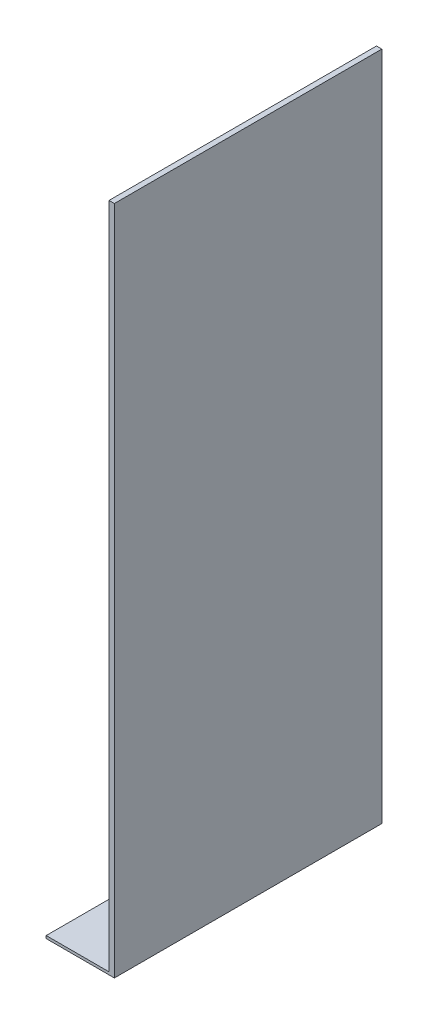
ISO-10303-21;
HEADER;
FILE_DESCRIPTION(('STEP AP214'),'2;1');
FILE_NAME('part.step','',(''),(''),'','','');
FILE_SCHEMA(('AUTOMOTIVE_DESIGN { 1 0 10303 214 1 1 1 1 }'));
ENDSEC;
DATA;
#1=APPLICATION_CONTEXT('core data for automotive mechanical design processes');
#2=APPLICATION_PROTOCOL_DEFINITION('international standard','automotive_design',2000,#1);
#3=PRODUCT_CONTEXT('',#1,'mechanical');
#4=PRODUCT('Part','Part','',(#3));
#5=PRODUCT_RELATED_PRODUCT_CATEGORY('part','',(#4));
#6=PRODUCT_DEFINITION_FORMATION('','',#4);
#7=PRODUCT_DEFINITION_CONTEXT('part definition',#1,'design');
#8=PRODUCT_DEFINITION('design','',#6,#7);
#9=PRODUCT_DEFINITION_SHAPE('','',#8);
#10=(LENGTH_UNIT() NAMED_UNIT(*) SI_UNIT(.MILLI.,.METRE.));
#11=(NAMED_UNIT(*) PLANE_ANGLE_UNIT() SI_UNIT($,.RADIAN.));
#12=(NAMED_UNIT(*) SI_UNIT($,.STERADIAN.) SOLID_ANGLE_UNIT());
#13=UNCERTAINTY_MEASURE_WITH_UNIT(LENGTH_MEASURE(1.E-05),#10,'distance_accuracy_value','');
#14=(GEOMETRIC_REPRESENTATION_CONTEXT(3) GLOBAL_UNCERTAINTY_ASSIGNED_CONTEXT((#13)) GLOBAL_UNIT_ASSIGNED_CONTEXT((#10,
#11,#12)) REPRESENTATION_CONTEXT('',''));
#15=CARTESIAN_POINT('',(0.,0.,0.));
#16=DIRECTION('',(0.,0.,1.));
#17=DIRECTION('',(1.,0.,0.));
#18=AXIS2_PLACEMENT_3D('',#15,#16,#17);
#19=CARTESIAN_POINT('',(0.,0.,0.));
#20=DIRECTION('',(1.,0.,0.));
#21=DIRECTION('',(0.,0.,-1.));
#22=AXIS2_PLACEMENT_3D('',#19,#20,#21);
#23=PLANE('',#22);
#24=DIRECTION('',(0.,0.,-1.));
#25=VECTOR('',#24,1.);
#26=CARTESIAN_POINT('',(0.,-395.820930232558,-61.2790697674419));
#27=LINE('',#26,#25);
#28=CARTESIAN_POINT('',(0.,-395.820930232558,138.720930232558));
#29=VERTEX_POINT('',#28);
#30=CARTESIAN_POINT('',(0.,-395.820930232558,-61.2790697674419));
#31=VERTEX_POINT('',#30);
#32=EDGE_CURVE('E57',#29,#31,#27,.T.);
#33=ORIENTED_EDGE('',*,*,#32,.F.);
#34=DIRECTION('',(0.,-1.,0.));
#35=VECTOR('',#34,1.);
#36=CARTESIAN_POINT('',(0.,103.779069767442,138.720930232558));
#37=LINE('',#36,#35);
#38=CARTESIAN_POINT('',(0.,103.779069767442,138.720930232558));
#39=VERTEX_POINT('',#38);
#40=EDGE_CURVE('E142',#39,#29,#37,.T.);
#41=ORIENTED_EDGE('',*,*,#40,.F.);
#42=DIRECTION('',(0.,0.,1.));
#43=VECTOR('',#42,1.);
#44=CARTESIAN_POINT('',(0.,103.779069767442,138.720930232558));
#45=LINE('',#44,#43);
#46=CARTESIAN_POINT('',(0.,103.779069767442,-61.2790697674419));
#47=VERTEX_POINT('',#46);
#48=EDGE_CURVE('E81',#47,#39,#45,.T.);
#49=ORIENTED_EDGE('',*,*,#48,.F.);
#50=DIRECTION('',(0.,1.,0.));
#51=VECTOR('',#50,1.);
#52=CARTESIAN_POINT('',(0.,103.779069767442,-61.2790697674419));
#53=LINE('',#52,#51);
#54=EDGE_CURVE('E155',#31,#47,#53,.T.);
#55=ORIENTED_EDGE('',*,*,#54,.F.);
#56=EDGE_LOOP('',(#33,#41,#49,#55));
#57=FACE_BOUND('',#56,.T.);
#58=ADVANCED_FACE('F41',(#57),#23,.F.);
#59=CARTESIAN_POINT('',(4.,103.779069767442,138.720930232558));
#60=DIRECTION('',(0.,0.,-1.));
#61=DIRECTION('',(0.,1.,0.));
#62=AXIS2_PLACEMENT_3D('',#59,#60,#61);
#63=PLANE('',#62);
#64=ORIENTED_EDGE('',*,*,#40,.T.);
#65=DIRECTION('',(1.,0.,0.));
#66=VECTOR('',#65,1.);
#67=CARTESIAN_POINT('',(-47.,-395.820930232558,138.720930232558));
#68=LINE('',#67,#66);
#69=CARTESIAN_POINT('',(-47.,-395.820930232558,138.720930232558));
#70=VERTEX_POINT('',#69);
#71=EDGE_CURVE('E138',#70,#29,#68,.T.);
#72=ORIENTED_EDGE('',*,*,#71,.F.);
#73=DIRECTION('',(0.,1.,0.));
#74=VECTOR('',#73,1.);
#75=CARTESIAN_POINT('',(-47.,-397.820930232558,138.720930232558));
#76=LINE('',#75,#74);
#77=CARTESIAN_POINT('',(-47.,-397.820930232558,138.720930232558));
#78=VERTEX_POINT('',#77);
#79=EDGE_CURVE('E120',#78,#70,#76,.T.);
#80=ORIENTED_EDGE('',*,*,#79,.F.);
#81=DIRECTION('',(-1.,0.,0.));
#82=VECTOR('',#81,1.);
#83=CARTESIAN_POINT('',(4.,-397.820930232558,138.720930232558));
#84=LINE('',#83,#82);
#85=CARTESIAN_POINT('',(4.,-397.820930232558,138.720930232558));
#86=VERTEX_POINT('',#85);
#87=EDGE_CURVE('E11',#86,#78,#84,.T.);
#88=ORIENTED_EDGE('',*,*,#87,.F.);
#89=DIRECTION('',(0.,-1.,0.));
#90=VECTOR('',#89,1.);
#91=CARTESIAN_POINT('',(4.,103.779069767442,138.720930232558));
#92=LINE('',#91,#90);
#93=CARTESIAN_POINT('',(4.,103.779069767442,138.720930232558));
#94=VERTEX_POINT('',#93);
#95=EDGE_CURVE('E143',#94,#86,#92,.T.);
#96=ORIENTED_EDGE('',*,*,#95,.F.);
#97=DIRECTION('',(-1.,0.,0.));
#98=VECTOR('',#97,1.);
#99=CARTESIAN_POINT('',(4.,103.779069767442,138.720930232558));
#100=LINE('',#99,#98);
#101=EDGE_CURVE('E152',#94,#39,#100,.T.);
#102=ORIENTED_EDGE('',*,*,#101,.T.);
#103=EDGE_LOOP('',(#64,#72,#80,#88,#96,#102));
#104=FACE_BOUND('',#103,.T.);
#105=ADVANCED_FACE('F43',(#104),#63,.F.);
#106=CARTESIAN_POINT('',(4.,-397.820930232558,138.720930232558));
#107=DIRECTION('',(0.,1.,0.));
#108=DIRECTION('',(0.,0.,1.));
#109=AXIS2_PLACEMENT_3D('',#106,#107,#108);
#110=PLANE('',#109);
#111=ORIENTED_EDGE('',*,*,#87,.T.);
#112=DIRECTION('',(0.,0.,1.));
#113=VECTOR('',#112,1.);
#114=CARTESIAN_POINT('',(-47.,-397.820930232558,-61.2790697674419));
#115=LINE('',#114,#113);
#116=CARTESIAN_POINT('',(-47.,-397.820930232558,-61.2790697674419));
#117=VERTEX_POINT('',#116);
#118=EDGE_CURVE('E114',#117,#78,#115,.T.);
#119=ORIENTED_EDGE('',*,*,#118,.F.);
#120=DIRECTION('',(-1.,0.,0.));
#121=VECTOR('',#120,1.);
#122=CARTESIAN_POINT('',(4.,-397.820930232558,-61.2790697674419));
#123=LINE('',#122,#121);
#124=CARTESIAN_POINT('',(4.,-397.820930232558,-61.2790697674419));
#125=VERTEX_POINT('',#124);
#126=EDGE_CURVE('E50',#125,#117,#123,.T.);
#127=ORIENTED_EDGE('',*,*,#126,.F.);
#128=DIRECTION('',(0.,0.,-1.));
#129=VECTOR('',#128,1.);
#130=CARTESIAN_POINT('',(4.,-397.820930232558,138.720930232558));
#131=LINE('',#130,#129);
#132=EDGE_CURVE('E88',#86,#125,#131,.T.);
#133=ORIENTED_EDGE('',*,*,#132,.F.);
#134=EDGE_LOOP('',(#111,#119,#127,#133));
#135=FACE_BOUND('',#134,.T.);
#136=ADVANCED_FACE('F115',(#135),#110,.F.);
#137=CARTESIAN_POINT('',(4.,103.779069767442,-61.2790697674419));
#138=DIRECTION('',(0.,0.,1.));
#139=DIRECTION('',(0.,-1.,0.));
#140=AXIS2_PLACEMENT_3D('',#137,#138,#139);
#141=PLANE('',#140);
#142=ORIENTED_EDGE('',*,*,#126,.T.);
#143=DIRECTION('',(0.,-1.,0.));
#144=VECTOR('',#143,1.);
#145=CARTESIAN_POINT('',(-47.,-397.820930232558,-61.2790697674419));
#146=LINE('',#145,#144);
#147=CARTESIAN_POINT('',(-47.,-395.820930232558,-61.2790697674419));
#148=VERTEX_POINT('',#147);
#149=EDGE_CURVE('E108',#148,#117,#146,.T.);
#150=ORIENTED_EDGE('',*,*,#149,.F.);
#151=DIRECTION('',(1.,0.,0.));
#152=VECTOR('',#151,1.);
#153=CARTESIAN_POINT('',(-47.,-395.820930232558,-61.2790697674419));
#154=LINE('',#153,#152);
#155=EDGE_CURVE('E134',#148,#31,#154,.T.);
#156=ORIENTED_EDGE('',*,*,#155,.T.);
#157=ORIENTED_EDGE('',*,*,#54,.T.);
#158=DIRECTION('',(-1.,0.,0.));
#159=VECTOR('',#158,1.);
#160=CARTESIAN_POINT('',(4.,103.779069767442,-61.2790697674419));
#161=LINE('',#160,#159);
#162=CARTESIAN_POINT('',(4.,103.779069767442,-61.2790697674419));
#163=VERTEX_POINT('',#162);
#164=EDGE_CURVE('E112',#163,#47,#161,.T.);
#165=ORIENTED_EDGE('',*,*,#164,.F.);
#166=DIRECTION('',(0.,1.,0.));
#167=VECTOR('',#166,1.);
#168=CARTESIAN_POINT('',(4.,103.779069767442,-61.2790697674419));
#169=LINE('',#168,#167);
#170=EDGE_CURVE('E110',#125,#163,#169,.T.);
#171=ORIENTED_EDGE('',*,*,#170,.F.);
#172=EDGE_LOOP('',(#142,#150,#156,#157,#165,#171));
#173=FACE_BOUND('',#172,.T.);
#174=ADVANCED_FACE('F105',(#173),#141,.F.);
#175=CARTESIAN_POINT('',(4.,103.779069767442,138.720930232558));
#176=DIRECTION('',(0.,-1.,0.));
#177=DIRECTION('',(0.,0.,-1.));
#178=AXIS2_PLACEMENT_3D('',#175,#176,#177);
#179=PLANE('',#178);
#180=ORIENTED_EDGE('',*,*,#48,.T.);
#181=ORIENTED_EDGE('',*,*,#101,.F.);
#182=DIRECTION('',(0.,0.,1.));
#183=VECTOR('',#182,1.);
#184=CARTESIAN_POINT('',(4.,103.779069767442,138.720930232558));
#185=LINE('',#184,#183);
#186=EDGE_CURVE('E66',#163,#94,#185,.T.);
#187=ORIENTED_EDGE('',*,*,#186,.F.);
#188=ORIENTED_EDGE('',*,*,#164,.T.);
#189=EDGE_LOOP('',(#180,#181,#187,#188));
#190=FACE_BOUND('',#189,.T.);
#191=ADVANCED_FACE('F163',(#190),#179,.F.);
#192=CARTESIAN_POINT('',(4.,0.,0.));
#193=DIRECTION('',(1.,0.,0.));
#194=DIRECTION('',(0.,0.,-1.));
#195=AXIS2_PLACEMENT_3D('',#192,#193,#194);
#196=PLANE('',#195);
#197=ORIENTED_EDGE('',*,*,#95,.T.);
#198=ORIENTED_EDGE('',*,*,#132,.T.);
#199=ORIENTED_EDGE('',*,*,#170,.T.);
#200=ORIENTED_EDGE('',*,*,#186,.T.);
#201=EDGE_LOOP('',(#197,#198,#199,#200));
#202=FACE_BOUND('',#201,.T.);
#203=ADVANCED_FACE('F170',(#202),#196,.T.);
#204=CARTESIAN_POINT('',(-47.,-395.820930232558,-61.2790697674419));
#205=DIRECTION('',(0.,-1.,0.));
#206=DIRECTION('',(0.,0.,-1.));
#207=AXIS2_PLACEMENT_3D('',#204,#205,#206);
#208=PLANE('',#207);
#209=ORIENTED_EDGE('',*,*,#32,.T.);
#210=ORIENTED_EDGE('',*,*,#155,.F.);
#211=DIRECTION('',(0.,0.,-1.));
#212=VECTOR('',#211,1.);
#213=CARTESIAN_POINT('',(-47.,-395.820930232558,-61.2790697674419));
#214=LINE('',#213,#212);
#215=EDGE_CURVE('E124',#70,#148,#214,.T.);
#216=ORIENTED_EDGE('',*,*,#215,.F.);
#217=ORIENTED_EDGE('',*,*,#71,.T.);
#218=EDGE_LOOP('',(#209,#210,#216,#217));
#219=FACE_BOUND('',#218,.T.);
#220=ADVANCED_FACE('F168',(#219),#208,.F.);
#221=CARTESIAN_POINT('',(-47.,0.,0.));
#222=DIRECTION('',(1.,0.,0.));
#223=DIRECTION('',(0.,0.,-1.));
#224=AXIS2_PLACEMENT_3D('',#221,#222,#223);
#225=PLANE('',#224);
#226=ORIENTED_EDGE('',*,*,#149,.T.);
#227=ORIENTED_EDGE('',*,*,#118,.T.);
#228=ORIENTED_EDGE('',*,*,#79,.T.);
#229=ORIENTED_EDGE('',*,*,#215,.T.);
#230=EDGE_LOOP('',(#226,#227,#228,#229));
#231=FACE_BOUND('',#230,.T.);
#232=ADVANCED_FACE('F122',(#231),#225,.F.);
#233=CLOSED_SHELL('',(#58,#105,#136,#174,#191,#203,#220,#232));
#234=MANIFOLD_SOLID_BREP('B2',#233);
#235=ADVANCED_BREP_SHAPE_REPRESENTATION('',(#18,#234),#14);
#236=SHAPE_DEFINITION_REPRESENTATION(#9,#235);
ENDSEC;
END-ISO-10303-21;
